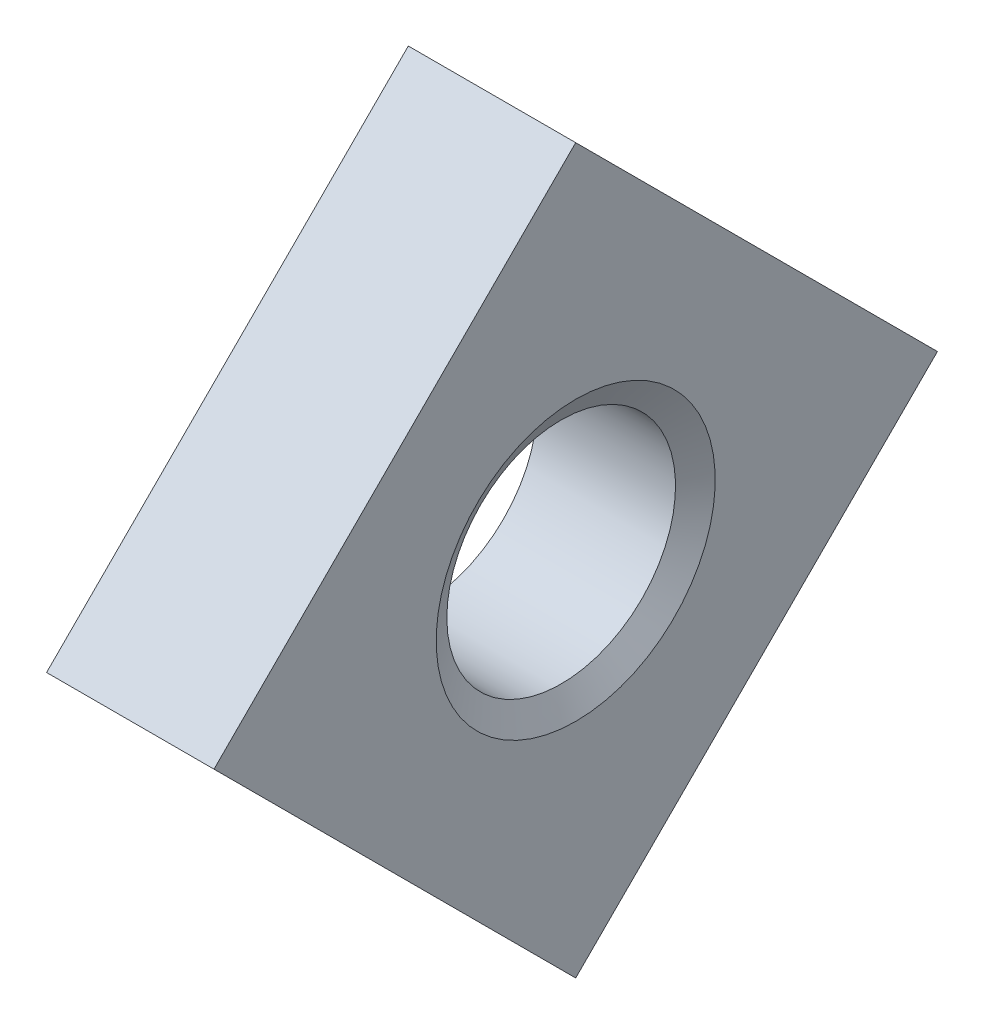
ISO-10303-21;
HEADER;
FILE_DESCRIPTION(('STEP AP214'),'2;1');
FILE_NAME('part.step','',(''),(''),'','','');
FILE_SCHEMA(('AUTOMOTIVE_DESIGN { 1 0 10303 214 1 1 1 1 }'));
ENDSEC;
DATA;
#1=APPLICATION_CONTEXT('core data for automotive mechanical design processes');
#2=APPLICATION_PROTOCOL_DEFINITION('international standard','automotive_design',2000,#1);
#3=PRODUCT_CONTEXT('',#1,'mechanical');
#4=PRODUCT('Part','Part','',(#3));
#5=PRODUCT_RELATED_PRODUCT_CATEGORY('part','',(#4));
#6=PRODUCT_DEFINITION_FORMATION('','',#4);
#7=PRODUCT_DEFINITION_CONTEXT('part definition',#1,'design');
#8=PRODUCT_DEFINITION('design','',#6,#7);
#9=PRODUCT_DEFINITION_SHAPE('','',#8);
#10=(LENGTH_UNIT() NAMED_UNIT(*) SI_UNIT(.MILLI.,.METRE.));
#11=(NAMED_UNIT(*) PLANE_ANGLE_UNIT() SI_UNIT($,.RADIAN.));
#12=(NAMED_UNIT(*) SI_UNIT($,.STERADIAN.) SOLID_ANGLE_UNIT());
#13=UNCERTAINTY_MEASURE_WITH_UNIT(LENGTH_MEASURE(1.E-05),#10,'distance_accuracy_value','');
#14=(GEOMETRIC_REPRESENTATION_CONTEXT(3) GLOBAL_UNCERTAINTY_ASSIGNED_CONTEXT((#13)) GLOBAL_UNIT_ASSIGNED_CONTEXT((#10,
#11,#12)) REPRESENTATION_CONTEXT('',''));
#15=CARTESIAN_POINT('',(0.,0.,0.));
#16=DIRECTION('',(0.,0.,1.));
#17=DIRECTION('',(1.,0.,0.));
#18=AXIS2_PLACEMENT_3D('',#15,#16,#17);
#19=CARTESIAN_POINT('',(1.721875,0.,0.));
#20=DIRECTION('',(1.,0.,0.));
#21=DIRECTION('',(0.,1.,0.));
#22=AXIS2_PLACEMENT_3D('',#19,#20,#21);
#23=CONICAL_SURFACE('',#22,1.36481646934132,1.0471975511966);
#24=CARTESIAN_POINT('',(1.64375,0.,0.));
#25=DIRECTION('',(-1.,0.,0.));
#26=DIRECTION('',(0.,0.,1.));
#27=AXIS2_PLACEMENT_3D('',#24,#25,#26);
#28=CIRCLE('',#27,1.2295);
#29=CARTESIAN_POINT('',(1.64375,0.,1.2295));
#30=VERTEX_POINT('',#29);
#31=EDGE_CURVE('E9',#30,#30,#28,.T.);
#32=ORIENTED_EDGE('',*,*,#31,.T.);
#33=EDGE_LOOP('',(#32));
#34=FACE_BOUND('',#33,.T.);
#35=CARTESIAN_POINT('',(1.8,0.,0.));
#36=DIRECTION('',(1.,0.,0.));
#37=DIRECTION('',(0.,1.,0.));
#38=AXIS2_PLACEMENT_3D('',#35,#36,#37);
#39=CIRCLE('',#38,1.50013293868264);
#40=CARTESIAN_POINT('',(1.8,1.50013293868264,0.));
#41=VERTEX_POINT('',#40);
#42=EDGE_CURVE('E25',#41,#41,#39,.T.);
#43=ORIENTED_EDGE('',*,*,#42,.T.);
#44=EDGE_LOOP('',(#43));
#45=FACE_BOUND('',#44,.T.);
#46=ADVANCED_FACE('F15',(#34,#45),#23,.F.);
#47=CARTESIAN_POINT('',(11.1462998344742,0.,0.));
#48=DIRECTION('',(-1.,0.,0.));
#49=DIRECTION('',(0.,0.,1.));
#50=AXIS2_PLACEMENT_3D('',#47,#48,#49);
#51=CYLINDRICAL_SURFACE('',#50,1.2295);
#52=CARTESIAN_POINT('',(0.15625,0.,0.));
#53=DIRECTION('',(1.,0.,0.));
#54=DIRECTION('',(0.,1.,0.));
#55=AXIS2_PLACEMENT_3D('',#52,#53,#54);
#56=CIRCLE('',#55,1.2295);
#57=CARTESIAN_POINT('',(0.15625,1.2295,0.));
#58=VERTEX_POINT('',#57);
#59=EDGE_CURVE('E93',#58,#58,#56,.T.);
#60=ORIENTED_EDGE('',*,*,#59,.F.);
#61=EDGE_LOOP('',(#60));
#62=FACE_BOUND('',#61,.T.);
#63=ORIENTED_EDGE('',*,*,#31,.F.);
#64=EDGE_LOOP('',(#63));
#65=FACE_BOUND('',#64,.T.);
#66=ADVANCED_FACE('F105',(#62,#65),#51,.F.);
#67=CARTESIAN_POINT('',(1.8,0.,0.));
#68=DIRECTION('',(1.,0.,0.));
#69=DIRECTION('',(0.,0.,-1.));
#70=AXIS2_PLACEMENT_3D('',#67,#68,#69);
#71=PLANE('',#70);
#72=DIRECTION('',(0.,0.707106781186547,0.707106781186548));
#73=VECTOR('',#72,1.);
#74=CARTESIAN_POINT('',(1.8,-3.88908729652601,0.));
#75=LINE('',#74,#73);
#76=CARTESIAN_POINT('',(1.8,-3.88908729652601,0.));
#77=VERTEX_POINT('',#76);
#78=CARTESIAN_POINT('',(1.8,0.,3.88908729652601));
#79=VERTEX_POINT('',#78);
#80=EDGE_CURVE('E68',#77,#79,#75,.T.);
#81=ORIENTED_EDGE('',*,*,#80,.F.);
#82=DIRECTION('',(0.,-0.707106781186548,0.707106781186547));
#83=VECTOR('',#82,1.);
#84=CARTESIAN_POINT('',(1.8,0.,-3.88908729652601));
#85=LINE('',#84,#83);
#86=CARTESIAN_POINT('',(1.8,0.,-3.88908729652601));
#87=VERTEX_POINT('',#86);
#88=EDGE_CURVE('E34',#87,#77,#85,.T.);
#89=ORIENTED_EDGE('',*,*,#88,.F.);
#90=DIRECTION('',(0.,-0.707106781186548,-0.707106781186548));
#91=VECTOR('',#90,1.);
#92=CARTESIAN_POINT('',(1.8,3.88908729652601,0.));
#93=LINE('',#92,#91);
#94=CARTESIAN_POINT('',(1.8,3.88908729652601,0.));
#95=VERTEX_POINT('',#94);
#96=EDGE_CURVE('E78',#95,#87,#93,.T.);
#97=ORIENTED_EDGE('',*,*,#96,.F.);
#98=DIRECTION('',(0.,0.707106781186548,-0.707106781186547));
#99=VECTOR('',#98,1.);
#100=CARTESIAN_POINT('',(1.8,0.,3.88908729652601));
#101=LINE('',#100,#99);
#102=EDGE_CURVE('E77',#79,#95,#101,.T.);
#103=ORIENTED_EDGE('',*,*,#102,.F.);
#104=EDGE_LOOP('',(#81,#89,#97,#103));
#105=FACE_BOUND('',#104,.T.);
#106=ORIENTED_EDGE('',*,*,#42,.F.);
#107=EDGE_LOOP('',(#106));
#108=FACE_BOUND('',#107,.T.);
#109=ADVANCED_FACE('F103',(#105,#108),#71,.T.);
#110=CARTESIAN_POINT('',(0.078125,0.,0.));
#111=DIRECTION('',(-1.,0.,0.));
#112=DIRECTION('',(0.,0.,1.));
#113=AXIS2_PLACEMENT_3D('',#110,#111,#112);
#114=CONICAL_SURFACE('',#113,1.36481646934132,1.0471975511966);
#115=ORIENTED_EDGE('',*,*,#59,.T.);
#116=EDGE_LOOP('',(#115));
#117=FACE_BOUND('',#116,.T.);
#118=CARTESIAN_POINT('',(0.,0.,0.));
#119=DIRECTION('',(-1.,0.,0.));
#120=DIRECTION('',(0.,0.,1.));
#121=AXIS2_PLACEMENT_3D('',#118,#119,#120);
#122=CIRCLE('',#121,1.50013293868264);
#123=CARTESIAN_POINT('',(0.,0.,1.50013293868264));
#124=VERTEX_POINT('',#123);
#125=EDGE_CURVE('E90',#124,#124,#122,.T.);
#126=ORIENTED_EDGE('',*,*,#125,.T.);
#127=EDGE_LOOP('',(#126));
#128=FACE_BOUND('',#127,.T.);
#129=ADVANCED_FACE('F17',(#117,#128),#114,.F.);
#130=CARTESIAN_POINT('',(0.,0.,0.));
#131=DIRECTION('',(1.,0.,0.));
#132=DIRECTION('',(0.,0.,-1.));
#133=AXIS2_PLACEMENT_3D('',#130,#131,#132);
#134=PLANE('',#133);
#135=DIRECTION('',(0.,-0.707106781186548,0.707106781186547));
#136=VECTOR('',#135,1.);
#137=CARTESIAN_POINT('',(0.,0.,-3.88908729652601));
#138=LINE('',#137,#136);
#139=CARTESIAN_POINT('',(0.,0.,-3.88908729652601));
#140=VERTEX_POINT('',#139);
#141=CARTESIAN_POINT('',(0.,-3.88908729652601,0.));
#142=VERTEX_POINT('',#141);
#143=EDGE_CURVE('E88',#140,#142,#138,.T.);
#144=ORIENTED_EDGE('',*,*,#143,.T.);
#145=DIRECTION('',(0.,0.707106781186547,0.707106781186548));
#146=VECTOR('',#145,1.);
#147=CARTESIAN_POINT('',(0.,-3.88908729652601,0.));
#148=LINE('',#147,#146);
#149=CARTESIAN_POINT('',(0.,0.,3.88908729652601));
#150=VERTEX_POINT('',#149);
#151=EDGE_CURVE('E72',#142,#150,#148,.T.);
#152=ORIENTED_EDGE('',*,*,#151,.T.);
#153=DIRECTION('',(0.,0.707106781186548,-0.707106781186547));
#154=VECTOR('',#153,1.);
#155=CARTESIAN_POINT('',(0.,0.,3.88908729652601));
#156=LINE('',#155,#154);
#157=CARTESIAN_POINT('',(0.,3.88908729652601,0.));
#158=VERTEX_POINT('',#157);
#159=EDGE_CURVE('E55',#150,#158,#156,.T.);
#160=ORIENTED_EDGE('',*,*,#159,.T.);
#161=DIRECTION('',(0.,-0.707106781186548,-0.707106781186548));
#162=VECTOR('',#161,1.);
#163=CARTESIAN_POINT('',(0.,3.88908729652601,0.));
#164=LINE('',#163,#162);
#165=EDGE_CURVE('E61',#158,#140,#164,.T.);
#166=ORIENTED_EDGE('',*,*,#165,.T.);
#167=EDGE_LOOP('',(#144,#152,#160,#166));
#168=FACE_BOUND('',#167,.T.);
#169=ORIENTED_EDGE('',*,*,#125,.F.);
#170=EDGE_LOOP('',(#169));
#171=FACE_BOUND('',#170,.T.);
#172=ADVANCED_FACE('F70',(#168,#171),#134,.F.);
#173=CARTESIAN_POINT('',(0.,-3.88908729652601,0.));
#174=DIRECTION('',(0.,-0.707106781186548,0.707106781186547));
#175=DIRECTION('',(0.,-0.707106781186547,-0.707106781186548));
#176=AXIS2_PLACEMENT_3D('',#173,#174,#175);
#177=PLANE('',#176);
#178=ORIENTED_EDGE('',*,*,#80,.T.);
#179=DIRECTION('',(1.,0.,0.));
#180=VECTOR('',#179,1.);
#181=CARTESIAN_POINT('',(0.,0.,3.88908729652601));
#182=LINE('',#181,#180);
#183=EDGE_CURVE('E79',#150,#79,#182,.T.);
#184=ORIENTED_EDGE('',*,*,#183,.F.);
#185=ORIENTED_EDGE('',*,*,#151,.F.);
#186=DIRECTION('',(1.,0.,0.));
#187=VECTOR('',#186,1.);
#188=CARTESIAN_POINT('',(0.,-3.88908729652601,0.));
#189=LINE('',#188,#187);
#190=EDGE_CURVE('E83',#142,#77,#189,.T.);
#191=ORIENTED_EDGE('',*,*,#190,.T.);
#192=EDGE_LOOP('',(#178,#184,#185,#191));
#193=FACE_BOUND('',#192,.T.);
#194=ADVANCED_FACE('F129',(#193),#177,.T.);
#195=CARTESIAN_POINT('',(0.,0.,3.88908729652601));
#196=DIRECTION('',(0.,0.707106781186547,0.707106781186548));
#197=DIRECTION('',(0.,-0.707106781186548,0.707106781186547));
#198=AXIS2_PLACEMENT_3D('',#195,#196,#197);
#199=PLANE('',#198);
#200=ORIENTED_EDGE('',*,*,#102,.T.);
#201=DIRECTION('',(1.,0.,0.));
#202=VECTOR('',#201,1.);
#203=CARTESIAN_POINT('',(0.,3.88908729652601,0.));
#204=LINE('',#203,#202);
#205=EDGE_CURVE('E64',#158,#95,#204,.T.);
#206=ORIENTED_EDGE('',*,*,#205,.F.);
#207=ORIENTED_EDGE('',*,*,#159,.F.);
#208=ORIENTED_EDGE('',*,*,#183,.T.);
#209=EDGE_LOOP('',(#200,#206,#207,#208));
#210=FACE_BOUND('',#209,.T.);
#211=ADVANCED_FACE('F76',(#210),#199,.T.);
#212=CARTESIAN_POINT('',(0.,3.88908729652601,0.));
#213=DIRECTION('',(0.,0.707106781186548,-0.707106781186548));
#214=DIRECTION('',(0.,0.707106781186548,0.707106781186548));
#215=AXIS2_PLACEMENT_3D('',#212,#213,#214);
#216=PLANE('',#215);
#217=ORIENTED_EDGE('',*,*,#96,.T.);
#218=DIRECTION('',(1.,0.,0.));
#219=VECTOR('',#218,1.);
#220=CARTESIAN_POINT('',(0.,0.,-3.88908729652601));
#221=LINE('',#220,#219);
#222=EDGE_CURVE('E19',#140,#87,#221,.T.);
#223=ORIENTED_EDGE('',*,*,#222,.F.);
#224=ORIENTED_EDGE('',*,*,#165,.F.);
#225=ORIENTED_EDGE('',*,*,#205,.T.);
#226=EDGE_LOOP('',(#217,#223,#224,#225));
#227=FACE_BOUND('',#226,.T.);
#228=ADVANCED_FACE('F63',(#227),#216,.T.);
#229=CARTESIAN_POINT('',(0.,0.,-3.88908729652601));
#230=DIRECTION('',(0.,-0.707106781186547,-0.707106781186548));
#231=DIRECTION('',(0.,0.707106781186548,-0.707106781186547));
#232=AXIS2_PLACEMENT_3D('',#229,#230,#231);
#233=PLANE('',#232);
#234=ORIENTED_EDGE('',*,*,#88,.T.);
#235=ORIENTED_EDGE('',*,*,#190,.F.);
#236=ORIENTED_EDGE('',*,*,#143,.F.);
#237=ORIENTED_EDGE('',*,*,#222,.T.);
#238=EDGE_LOOP('',(#234,#235,#236,#237));
#239=FACE_BOUND('',#238,.T.);
#240=ADVANCED_FACE('F122',(#239),#233,.T.);
#241=CLOSED_SHELL('',(#46,#66,#109,#129,#172,#194,#211,#228,#240));
#242=MANIFOLD_SOLID_BREP('B1',#241);
#243=ADVANCED_BREP_SHAPE_REPRESENTATION('',(#18,#242),#14);
#244=SHAPE_DEFINITION_REPRESENTATION(#9,#243);
ENDSEC;
END-ISO-10303-21;
